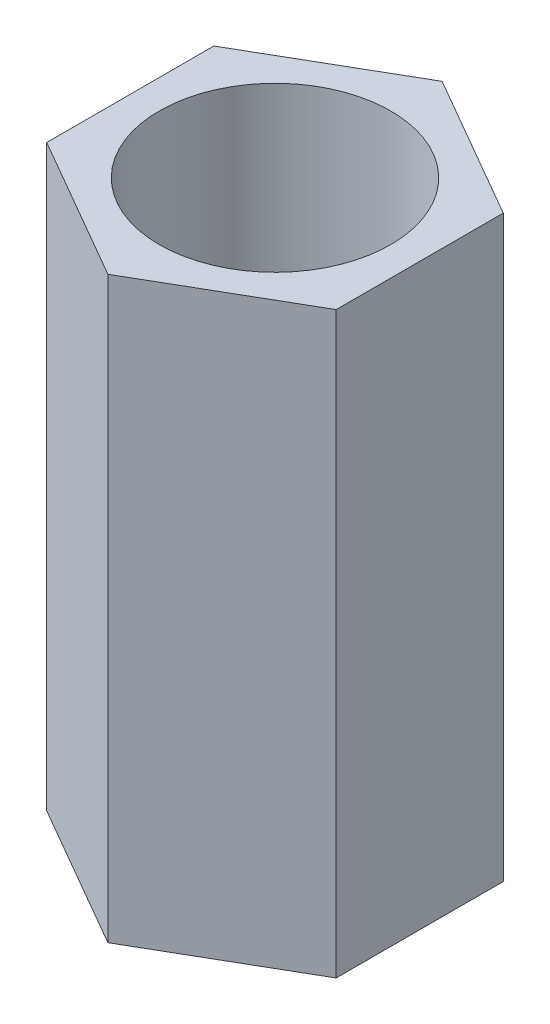
ISO-10303-21;
HEADER;
FILE_DESCRIPTION(('STEP AP214'),'2;1');
FILE_NAME('part.step','',(''),(''),'','','');
FILE_SCHEMA(('AUTOMOTIVE_DESIGN { 1 0 10303 214 1 1 1 1 }'));
ENDSEC;
DATA;
#1=APPLICATION_CONTEXT('core data for automotive mechanical design processes');
#2=APPLICATION_PROTOCOL_DEFINITION('international standard','automotive_design',2000,#1);
#3=PRODUCT_CONTEXT('',#1,'mechanical');
#4=PRODUCT('Part','Part','',(#3));
#5=PRODUCT_RELATED_PRODUCT_CATEGORY('part','',(#4));
#6=PRODUCT_DEFINITION_FORMATION('','',#4);
#7=PRODUCT_DEFINITION_CONTEXT('part definition',#1,'design');
#8=PRODUCT_DEFINITION('design','',#6,#7);
#9=PRODUCT_DEFINITION_SHAPE('','',#8);
#10=(LENGTH_UNIT() NAMED_UNIT(*) SI_UNIT(.MILLI.,.METRE.));
#11=(NAMED_UNIT(*) PLANE_ANGLE_UNIT() SI_UNIT($,.RADIAN.));
#12=(NAMED_UNIT(*) SI_UNIT($,.STERADIAN.) SOLID_ANGLE_UNIT());
#13=UNCERTAINTY_MEASURE_WITH_UNIT(LENGTH_MEASURE(1.E-05),#10,'distance_accuracy_value','');
#14=(GEOMETRIC_REPRESENTATION_CONTEXT(3) GLOBAL_UNCERTAINTY_ASSIGNED_CONTEXT((#13)) GLOBAL_UNIT_ASSIGNED_CONTEXT((#10,
#11,#12)) REPRESENTATION_CONTEXT('',''));
#15=CARTESIAN_POINT('',(0.,0.,0.));
#16=DIRECTION('',(0.,0.,1.));
#17=DIRECTION('',(1.,0.,0.));
#18=AXIS2_PLACEMENT_3D('',#15,#16,#17);
#19=CARTESIAN_POINT('',(0.,10.,0.));
#20=DIRECTION('',(0.,1.,0.));
#21=DIRECTION('',(0.,0.,1.));
#22=AXIS2_PLACEMENT_3D('',#19,#20,#21);
#23=PLANE('',#22);
#24=DIRECTION('',(-0.866025403784439,0.,-0.5));
#25=VECTOR('',#24,1.);
#26=CARTESIAN_POINT('',(2.5,10.,-1.44337567297406));
#27=LINE('',#26,#25);
#28=CARTESIAN_POINT('',(2.5,10.,-1.44337567297406));
#29=VERTEX_POINT('',#28);
#30=CARTESIAN_POINT('',(0.,10.,-2.88675134594813));
#31=VERTEX_POINT('',#30);
#32=EDGE_CURVE('E130',#29,#31,#27,.T.);
#33=ORIENTED_EDGE('',*,*,#32,.T.);
#34=DIRECTION('',(-0.866025403784438,0.,0.5));
#35=VECTOR('',#34,1.);
#36=CARTESIAN_POINT('',(0.,10.,-2.88675134594813));
#37=LINE('',#36,#35);
#38=CARTESIAN_POINT('',(-2.5,10.,-1.44337567297406));
#39=VERTEX_POINT('',#38);
#40=EDGE_CURVE('E88',#31,#39,#37,.T.);
#41=ORIENTED_EDGE('',*,*,#40,.T.);
#42=DIRECTION('',(0.,0.,1.));
#43=VECTOR('',#42,1.);
#44=CARTESIAN_POINT('',(-2.5,10.,-1.44337567297406));
#45=LINE('',#44,#43);
#46=CARTESIAN_POINT('',(-2.5,10.,1.44337567297406));
#47=VERTEX_POINT('',#46);
#48=EDGE_CURVE('E101',#39,#47,#45,.T.);
#49=ORIENTED_EDGE('',*,*,#48,.T.);
#50=DIRECTION('',(0.866025403784439,0.,0.5));
#51=VECTOR('',#50,1.);
#52=CARTESIAN_POINT('',(-2.5,10.,1.44337567297406));
#53=LINE('',#52,#51);
#54=CARTESIAN_POINT('',(0.,10.,2.88675134594813));
#55=VERTEX_POINT('',#54);
#56=EDGE_CURVE('E95',#47,#55,#53,.T.);
#57=ORIENTED_EDGE('',*,*,#56,.T.);
#58=DIRECTION('',(0.866025403784439,0.,-0.5));
#59=VECTOR('',#58,1.);
#60=CARTESIAN_POINT('',(0.,10.,2.88675134594813));
#61=LINE('',#60,#59);
#62=CARTESIAN_POINT('',(2.5,10.,1.44337567297406));
#63=VERTEX_POINT('',#62);
#64=EDGE_CURVE('E99',#55,#63,#61,.T.);
#65=ORIENTED_EDGE('',*,*,#64,.T.);
#66=DIRECTION('',(0.,0.,-1.));
#67=VECTOR('',#66,1.);
#68=CARTESIAN_POINT('',(2.5,10.,1.44337567297406));
#69=LINE('',#68,#67);
#70=EDGE_CURVE('E51',#63,#29,#69,.T.);
#71=ORIENTED_EDGE('',*,*,#70,.T.);
#72=EDGE_LOOP('',(#33,#41,#49,#57,#65,#71));
#73=FACE_BOUND('',#72,.T.);
#74=CARTESIAN_POINT('',(0.,10.,0.));
#75=DIRECTION('',(0.,1.,0.));
#76=DIRECTION('',(0.,0.,1.));
#77=AXIS2_PLACEMENT_3D('',#74,#75,#76);
#78=CIRCLE('',#77,2.);
#79=CARTESIAN_POINT('',(0.,10.,2.));
#80=VERTEX_POINT('',#79);
#81=EDGE_CURVE('E123',#80,#80,#78,.T.);
#82=ORIENTED_EDGE('',*,*,#81,.F.);
#83=EDGE_LOOP('',(#82));
#84=FACE_BOUND('',#83,.T.);
#85=ADVANCED_FACE('F34',(#73,#84),#23,.T.);
#86=CARTESIAN_POINT('',(0.,0.,0.));
#87=DIRECTION('',(0.,1.,0.));
#88=DIRECTION('',(0.,0.,1.));
#89=AXIS2_PLACEMENT_3D('',#86,#87,#88);
#90=PLANE('',#89);
#91=DIRECTION('',(-0.866025403784439,0.,-0.5));
#92=VECTOR('',#91,1.);
#93=CARTESIAN_POINT('',(2.5,0.,-1.44337567297406));
#94=LINE('',#93,#92);
#95=CARTESIAN_POINT('',(2.5,0.,-1.44337567297406));
#96=VERTEX_POINT('',#95);
#97=CARTESIAN_POINT('',(0.,0.,-2.88675134594813));
#98=VERTEX_POINT('',#97);
#99=EDGE_CURVE('E119',#96,#98,#94,.T.);
#100=ORIENTED_EDGE('',*,*,#99,.F.);
#101=DIRECTION('',(0.,0.,-1.));
#102=VECTOR('',#101,1.);
#103=CARTESIAN_POINT('',(2.5,0.,1.44337567297406));
#104=LINE('',#103,#102);
#105=CARTESIAN_POINT('',(2.5,0.,1.44337567297406));
#106=VERTEX_POINT('',#105);
#107=EDGE_CURVE('E80',#106,#96,#104,.T.);
#108=ORIENTED_EDGE('',*,*,#107,.F.);
#109=DIRECTION('',(0.866025403784439,0.,-0.5));
#110=VECTOR('',#109,1.);
#111=CARTESIAN_POINT('',(0.,0.,2.88675134594813));
#112=LINE('',#111,#110);
#113=CARTESIAN_POINT('',(0.,0.,2.88675134594813));
#114=VERTEX_POINT('',#113);
#115=EDGE_CURVE('E74',#114,#106,#112,.T.);
#116=ORIENTED_EDGE('',*,*,#115,.F.);
#117=DIRECTION('',(0.866025403784439,0.,0.5));
#118=VECTOR('',#117,1.);
#119=CARTESIAN_POINT('',(-2.5,0.,1.44337567297406));
#120=LINE('',#119,#118);
#121=CARTESIAN_POINT('',(-2.5,0.,1.44337567297406));
#122=VERTEX_POINT('',#121);
#123=EDGE_CURVE('E109',#122,#114,#120,.T.);
#124=ORIENTED_EDGE('',*,*,#123,.F.);
#125=DIRECTION('',(0.,0.,1.));
#126=VECTOR('',#125,1.);
#127=CARTESIAN_POINT('',(-2.5,0.,-1.44337567297406));
#128=LINE('',#127,#126);
#129=CARTESIAN_POINT('',(-2.5,0.,-1.44337567297406));
#130=VERTEX_POINT('',#129);
#131=EDGE_CURVE('E125',#130,#122,#128,.T.);
#132=ORIENTED_EDGE('',*,*,#131,.F.);
#133=DIRECTION('',(-0.866025403784438,0.,0.5));
#134=VECTOR('',#133,1.);
#135=CARTESIAN_POINT('',(0.,0.,-2.88675134594813));
#136=LINE('',#135,#134);
#137=EDGE_CURVE('E122',#98,#130,#136,.T.);
#138=ORIENTED_EDGE('',*,*,#137,.F.);
#139=EDGE_LOOP('',(#100,#108,#116,#124,#132,#138));
#140=FACE_BOUND('',#139,.T.);
#141=CARTESIAN_POINT('',(0.,0.,0.));
#142=DIRECTION('',(0.,1.,0.));
#143=DIRECTION('',(0.,0.,1.));
#144=AXIS2_PLACEMENT_3D('',#141,#142,#143);
#145=CIRCLE('',#144,2.);
#146=CARTESIAN_POINT('',(0.,0.,2.));
#147=VERTEX_POINT('',#146);
#148=EDGE_CURVE('E223',#147,#147,#145,.T.);
#149=ORIENTED_EDGE('',*,*,#148,.T.);
#150=EDGE_LOOP('',(#149));
#151=FACE_BOUND('',#150,.T.);
#152=ADVANCED_FACE('F139',(#140,#151),#90,.F.);
#153=CARTESIAN_POINT('',(2.5,10.,-1.44337567297406));
#154=DIRECTION('',(-0.5,0.,0.866025403784439));
#155=DIRECTION('',(0.866025403784439,0.,0.5));
#156=AXIS2_PLACEMENT_3D('',#153,#154,#155);
#157=PLANE('',#156);
#158=ORIENTED_EDGE('',*,*,#99,.T.);
#159=DIRECTION('',(0.,-1.,0.));
#160=VECTOR('',#159,1.);
#161=CARTESIAN_POINT('',(0.,10.,-2.88675134594813));
#162=LINE('',#161,#160);
#163=EDGE_CURVE('E11',#31,#98,#162,.T.);
#164=ORIENTED_EDGE('',*,*,#163,.F.);
#165=ORIENTED_EDGE('',*,*,#32,.F.);
#166=DIRECTION('',(0.,-1.,0.));
#167=VECTOR('',#166,1.);
#168=CARTESIAN_POINT('',(2.5,10.,-1.44337567297406));
#169=LINE('',#168,#167);
#170=EDGE_CURVE('E115',#29,#96,#169,.T.);
#171=ORIENTED_EDGE('',*,*,#170,.T.);
#172=EDGE_LOOP('',(#158,#164,#165,#171));
#173=FACE_BOUND('',#172,.T.);
#174=ADVANCED_FACE('F36',(#173),#157,.F.);
#175=CARTESIAN_POINT('',(0.,10.,-2.88675134594813));
#176=DIRECTION('',(0.5,0.,0.866025403784438));
#177=DIRECTION('',(0.866025403784439,0.,-0.5));
#178=AXIS2_PLACEMENT_3D('',#175,#176,#177);
#179=PLANE('',#178);
#180=ORIENTED_EDGE('',*,*,#137,.T.);
#181=DIRECTION('',(0.,-1.,0.));
#182=VECTOR('',#181,1.);
#183=CARTESIAN_POINT('',(-2.5,10.,-1.44337567297406));
#184=LINE('',#183,#182);
#185=EDGE_CURVE('E43',#39,#130,#184,.T.);
#186=ORIENTED_EDGE('',*,*,#185,.F.);
#187=ORIENTED_EDGE('',*,*,#40,.F.);
#188=ORIENTED_EDGE('',*,*,#163,.T.);
#189=EDGE_LOOP('',(#180,#186,#187,#188));
#190=FACE_BOUND('',#189,.T.);
#191=ADVANCED_FACE('F164',(#190),#179,.F.);
#192=CARTESIAN_POINT('',(-2.5,10.,-1.44337567297406));
#193=DIRECTION('',(1.,0.,0.));
#194=DIRECTION('',(0.,0.,-1.));
#195=AXIS2_PLACEMENT_3D('',#192,#193,#194);
#196=PLANE('',#195);
#197=ORIENTED_EDGE('',*,*,#131,.T.);
#198=DIRECTION('',(0.,-1.,0.));
#199=VECTOR('',#198,1.);
#200=CARTESIAN_POINT('',(-2.5,10.,1.44337567297406));
#201=LINE('',#200,#199);
#202=EDGE_CURVE('E110',#47,#122,#201,.T.);
#203=ORIENTED_EDGE('',*,*,#202,.F.);
#204=ORIENTED_EDGE('',*,*,#48,.F.);
#205=ORIENTED_EDGE('',*,*,#185,.T.);
#206=EDGE_LOOP('',(#197,#203,#204,#205));
#207=FACE_BOUND('',#206,.T.);
#208=ADVANCED_FACE('F136',(#207),#196,.F.);
#209=CARTESIAN_POINT('',(-2.5,10.,1.44337567297406));
#210=DIRECTION('',(0.5,0.,-0.866025403784438));
#211=DIRECTION('',(-0.866025403784439,0.,-0.5));
#212=AXIS2_PLACEMENT_3D('',#209,#210,#211);
#213=PLANE('',#212);
#214=ORIENTED_EDGE('',*,*,#123,.T.);
#215=DIRECTION('',(0.,-1.,0.));
#216=VECTOR('',#215,1.);
#217=CARTESIAN_POINT('',(0.,10.,2.88675134594813));
#218=LINE('',#217,#216);
#219=EDGE_CURVE('E106',#55,#114,#218,.T.);
#220=ORIENTED_EDGE('',*,*,#219,.F.);
#221=ORIENTED_EDGE('',*,*,#56,.F.);
#222=ORIENTED_EDGE('',*,*,#202,.T.);
#223=EDGE_LOOP('',(#214,#220,#221,#222));
#224=FACE_BOUND('',#223,.T.);
#225=ADVANCED_FACE('F107',(#224),#213,.F.);
#226=CARTESIAN_POINT('',(0.,10.,2.88675134594813));
#227=DIRECTION('',(-0.5,0.,-0.866025403784439));
#228=DIRECTION('',(-0.866025403784439,0.,0.5));
#229=AXIS2_PLACEMENT_3D('',#226,#227,#228);
#230=PLANE('',#229);
#231=ORIENTED_EDGE('',*,*,#115,.T.);
#232=DIRECTION('',(0.,-1.,0.));
#233=VECTOR('',#232,1.);
#234=CARTESIAN_POINT('',(2.5,10.,1.44337567297406));
#235=LINE('',#234,#233);
#236=EDGE_CURVE('E111',#63,#106,#235,.T.);
#237=ORIENTED_EDGE('',*,*,#236,.F.);
#238=ORIENTED_EDGE('',*,*,#64,.F.);
#239=ORIENTED_EDGE('',*,*,#219,.T.);
#240=EDGE_LOOP('',(#231,#237,#238,#239));
#241=FACE_BOUND('',#240,.T.);
#242=ADVANCED_FACE('F113',(#241),#230,.F.);
#243=CARTESIAN_POINT('',(2.5,10.,1.44337567297406));
#244=DIRECTION('',(-1.,0.,0.));
#245=DIRECTION('',(0.,0.,1.));
#246=AXIS2_PLACEMENT_3D('',#243,#244,#245);
#247=PLANE('',#246);
#248=ORIENTED_EDGE('',*,*,#107,.T.);
#249=ORIENTED_EDGE('',*,*,#170,.F.);
#250=ORIENTED_EDGE('',*,*,#70,.F.);
#251=ORIENTED_EDGE('',*,*,#236,.T.);
#252=EDGE_LOOP('',(#248,#249,#250,#251));
#253=FACE_BOUND('',#252,.T.);
#254=ADVANCED_FACE('F144',(#253),#247,.F.);
#255=CARTESIAN_POINT('',(0.,10.,0.));
#256=DIRECTION('',(0.,-1.,0.));
#257=DIRECTION('',(0.,0.,-1.));
#258=AXIS2_PLACEMENT_3D('',#255,#256,#257);
#259=CYLINDRICAL_SURFACE('',#258,2.);
#260=ORIENTED_EDGE('',*,*,#81,.T.);
#261=EDGE_LOOP('',(#260));
#262=FACE_BOUND('',#261,.T.);
#263=ORIENTED_EDGE('',*,*,#148,.F.);
#264=EDGE_LOOP('',(#263));
#265=FACE_BOUND('',#264,.T.);
#266=ADVANCED_FACE('F146',(#262,#265),#259,.F.);
#267=CLOSED_SHELL('',(#85,#152,#174,#191,#208,#225,#242,#254,#266));
#268=MANIFOLD_SOLID_BREP('B2',#267);
#269=ADVANCED_BREP_SHAPE_REPRESENTATION('',(#18,#268),#14);
#270=SHAPE_DEFINITION_REPRESENTATION(#9,#269);
ENDSEC;
END-ISO-10303-21;
